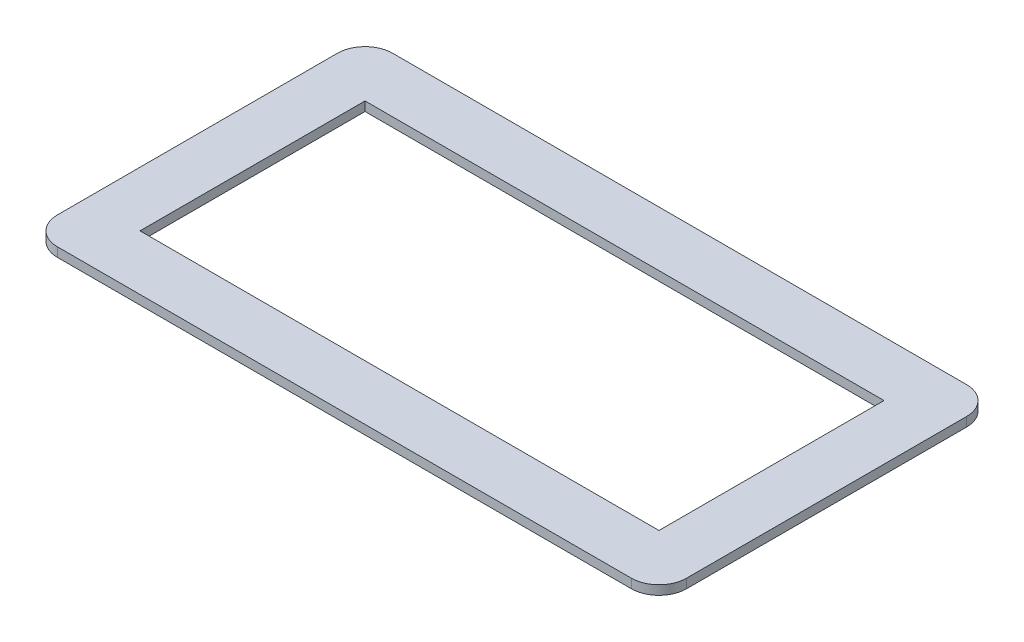
ISO-10303-21;
HEADER;
FILE_DESCRIPTION(('STEP AP214'),'2;1');
FILE_NAME('part.step','',(''),(''),'','','');
FILE_SCHEMA(('AUTOMOTIVE_DESIGN { 1 0 10303 214 1 1 1 1 }'));
ENDSEC;
DATA;
#1=APPLICATION_CONTEXT('core data for automotive mechanical design processes');
#2=APPLICATION_PROTOCOL_DEFINITION('international standard','automotive_design',2000,#1);
#3=PRODUCT_CONTEXT('',#1,'mechanical');
#4=PRODUCT('Part','Part','',(#3));
#5=PRODUCT_RELATED_PRODUCT_CATEGORY('part','',(#4));
#6=PRODUCT_DEFINITION_FORMATION('','',#4);
#7=PRODUCT_DEFINITION_CONTEXT('part definition',#1,'design');
#8=PRODUCT_DEFINITION('design','',#6,#7);
#9=PRODUCT_DEFINITION_SHAPE('','',#8);
#10=(LENGTH_UNIT() NAMED_UNIT(*) SI_UNIT(.MILLI.,.METRE.));
#11=(NAMED_UNIT(*) PLANE_ANGLE_UNIT() SI_UNIT($,.RADIAN.));
#12=(NAMED_UNIT(*) SI_UNIT($,.STERADIAN.) SOLID_ANGLE_UNIT());
#13=UNCERTAINTY_MEASURE_WITH_UNIT(LENGTH_MEASURE(1.E-05),#10,'distance_accuracy_value','');
#14=(GEOMETRIC_REPRESENTATION_CONTEXT(3) GLOBAL_UNCERTAINTY_ASSIGNED_CONTEXT((#13)) GLOBAL_UNIT_ASSIGNED_CONTEXT((#10,
#11,#12)) REPRESENTATION_CONTEXT('',''));
#15=CARTESIAN_POINT('',(0.,0.,0.));
#16=DIRECTION('',(0.,0.,1.));
#17=DIRECTION('',(1.,0.,0.));
#18=AXIS2_PLACEMENT_3D('',#15,#16,#17);
#19=CARTESIAN_POINT('',(0.,1.,0.));
#20=DIRECTION('',(0.,1.,0.));
#21=DIRECTION('',(0.,0.,1.));
#22=AXIS2_PLACEMENT_3D('',#19,#20,#21);
#23=PLANE('',#22);
#24=DIRECTION('',(0.,0.,-1.));
#25=VECTOR('',#24,1.);
#26=CARTESIAN_POINT('',(-90.6274509803921,1.,-66.9411764705883));
#27=LINE('',#26,#25);
#28=CARTESIAN_POINT('',(-90.6274509803921,1.,-33.4411764705883));
#29=VERTEX_POINT('',#28);
#30=CARTESIAN_POINT('',(-90.6274509803921,1.,-63.9411764705883));
#31=VERTEX_POINT('',#30);
#32=EDGE_CURVE('E191',#29,#31,#27,.T.);
#33=ORIENTED_EDGE('',*,*,#32,.T.);
#34=CARTESIAN_POINT('',(-93.6274509803921,1.,-63.9411764705883));
#35=DIRECTION('',(0.,1.,0.));
#36=DIRECTION('',(0.,0.,1.));
#37=AXIS2_PLACEMENT_3D('',#34,#35,#36);
#38=CIRCLE('',#37,3.);
#39=CARTESIAN_POINT('',(-93.6274509803921,1.,-66.9411764705883));
#40=VERTEX_POINT('',#39);
#41=EDGE_CURVE('E246',#31,#40,#38,.T.);
#42=ORIENTED_EDGE('',*,*,#41,.T.);
#43=DIRECTION('',(-1.,0.,0.));
#44=VECTOR('',#43,1.);
#45=CARTESIAN_POINT('',(-159.127450980392,1.,-66.9411764705883));
#46=LINE('',#45,#44);
#47=CARTESIAN_POINT('',(-156.127450980392,1.,-66.9411764705883));
#48=VERTEX_POINT('',#47);
#49=EDGE_CURVE('E195',#40,#48,#46,.T.);
#50=ORIENTED_EDGE('',*,*,#49,.T.);
#51=CARTESIAN_POINT('',(-156.127450980392,1.,-63.9411764705883));
#52=DIRECTION('',(0.,1.,0.));
#53=DIRECTION('',(0.,0.,1.));
#54=AXIS2_PLACEMENT_3D('',#51,#52,#53);
#55=CIRCLE('',#54,3.);
#56=CARTESIAN_POINT('',(-159.127450980392,1.,-63.9411764705883));
#57=VERTEX_POINT('',#56);
#58=EDGE_CURVE('E238',#48,#57,#55,.T.);
#59=ORIENTED_EDGE('',*,*,#58,.T.);
#60=DIRECTION('',(0.,0.,1.));
#61=VECTOR('',#60,1.);
#62=CARTESIAN_POINT('',(-159.127450980392,1.,-66.9411764705883));
#63=LINE('',#62,#61);
#64=CARTESIAN_POINT('',(-159.127450980392,1.,-33.4411764705883));
#65=VERTEX_POINT('',#64);
#66=EDGE_CURVE('E184',#57,#65,#63,.T.);
#67=ORIENTED_EDGE('',*,*,#66,.T.);
#68=CARTESIAN_POINT('',(-156.127450980392,1.,-33.4411764705883));
#69=DIRECTION('',(0.,1.,0.));
#70=DIRECTION('',(0.,0.,1.));
#71=AXIS2_PLACEMENT_3D('',#68,#69,#70);
#72=CIRCLE('',#71,3.);
#73=CARTESIAN_POINT('',(-156.127450980392,1.,-30.4411764705883));
#74=VERTEX_POINT('',#73);
#75=EDGE_CURVE('E62',#65,#74,#72,.T.);
#76=ORIENTED_EDGE('',*,*,#75,.T.);
#77=DIRECTION('',(1.,0.,0.));
#78=VECTOR('',#77,1.);
#79=CARTESIAN_POINT('',(-159.127450980392,1.,-30.4411764705883));
#80=LINE('',#79,#78);
#81=CARTESIAN_POINT('',(-93.6274509803921,1.,-30.4411764705883));
#82=VERTEX_POINT('',#81);
#83=EDGE_CURVE('E187',#74,#82,#80,.T.);
#84=ORIENTED_EDGE('',*,*,#83,.T.);
#85=CARTESIAN_POINT('',(-93.6274509803921,1.,-33.4411764705883));
#86=DIRECTION('',(0.,1.,0.));
#87=DIRECTION('',(0.,0.,1.));
#88=AXIS2_PLACEMENT_3D('',#85,#86,#87);
#89=CIRCLE('',#88,3.);
#90=EDGE_CURVE('E243',#82,#29,#89,.T.);
#91=ORIENTED_EDGE('',*,*,#90,.T.);
#92=EDGE_LOOP('',(#33,#42,#50,#59,#67,#76,#84,#91));
#93=FACE_BOUND('',#92,.T.);
#94=DIRECTION('',(1.,0.,0.));
#95=VECTOR('',#94,1.);
#96=CARTESIAN_POINT('',(-153.127450980392,1.,-36.4411764705883));
#97=LINE('',#96,#95);
#98=CARTESIAN_POINT('',(-153.127450980392,1.,-36.4411764705883));
#99=VERTEX_POINT('',#98);
#100=CARTESIAN_POINT('',(-96.6274509803921,1.,-36.4411764705883));
#101=VERTEX_POINT('',#100);
#102=EDGE_CURVE('E142',#99,#101,#97,.T.);
#103=ORIENTED_EDGE('',*,*,#102,.F.);
#104=DIRECTION('',(0.,0.,1.));
#105=VECTOR('',#104,1.);
#106=CARTESIAN_POINT('',(-153.127450980392,1.,-60.9411764705883));
#107=LINE('',#106,#105);
#108=CARTESIAN_POINT('',(-153.127450980392,1.,-60.9411764705883));
#109=VERTEX_POINT('',#108);
#110=EDGE_CURVE('E131',#109,#99,#107,.T.);
#111=ORIENTED_EDGE('',*,*,#110,.F.);
#112=DIRECTION('',(-1.,0.,0.));
#113=VECTOR('',#112,1.);
#114=CARTESIAN_POINT('',(-153.127450980392,1.,-60.9411764705883));
#115=LINE('',#114,#113);
#116=CARTESIAN_POINT('',(-96.6274509803921,1.,-60.9411764705883));
#117=VERTEX_POINT('',#116);
#118=EDGE_CURVE('E160',#117,#109,#115,.T.);
#119=ORIENTED_EDGE('',*,*,#118,.F.);
#120=DIRECTION('',(0.,0.,-1.));
#121=VECTOR('',#120,1.);
#122=CARTESIAN_POINT('',(-96.6274509803921,1.,-60.9411764705883));
#123=LINE('',#122,#121);
#124=EDGE_CURVE('E156',#101,#117,#123,.T.);
#125=ORIENTED_EDGE('',*,*,#124,.F.);
#126=EDGE_LOOP('',(#103,#111,#119,#125));
#127=FACE_BOUND('',#126,.T.);
#128=ADVANCED_FACE('F39',(#93,#127),#23,.T.);
#129=CARTESIAN_POINT('',(0.,0.,0.));
#130=DIRECTION('',(0.,1.,0.));
#131=DIRECTION('',(0.,0.,1.));
#132=AXIS2_PLACEMENT_3D('',#129,#130,#131);
#133=PLANE('',#132);
#134=DIRECTION('',(-1.,0.,0.));
#135=VECTOR('',#134,1.);
#136=CARTESIAN_POINT('',(-159.127450980392,0.,-66.9411764705883));
#137=LINE('',#136,#135);
#138=CARTESIAN_POINT('',(-93.6274509803921,0.,-66.9411764705883));
#139=VERTEX_POINT('',#138);
#140=CARTESIAN_POINT('',(-156.127450980392,0.,-66.9411764705883));
#141=VERTEX_POINT('',#140);
#142=EDGE_CURVE('E188',#139,#141,#137,.T.);
#143=ORIENTED_EDGE('',*,*,#142,.F.);
#144=CARTESIAN_POINT('',(-93.6274509803921,0.,-63.9411764705883));
#145=DIRECTION('',(0.,1.,0.));
#146=DIRECTION('',(0.,0.,1.));
#147=AXIS2_PLACEMENT_3D('',#144,#145,#146);
#148=CIRCLE('',#147,3.);
#149=CARTESIAN_POINT('',(-90.6274509803921,0.,-63.9411764705883));
#150=VERTEX_POINT('',#149);
#151=EDGE_CURVE('E228',#139,#150,#148,.F.);
#152=ORIENTED_EDGE('',*,*,#151,.T.);
#153=DIRECTION('',(0.,0.,-1.));
#154=VECTOR('',#153,1.);
#155=CARTESIAN_POINT('',(-90.6274509803921,0.,-66.9411764705883));
#156=LINE('',#155,#154);
#157=CARTESIAN_POINT('',(-90.6274509803921,0.,-33.4411764705883));
#158=VERTEX_POINT('',#157);
#159=EDGE_CURVE('E206',#158,#150,#156,.T.);
#160=ORIENTED_EDGE('',*,*,#159,.F.);
#161=CARTESIAN_POINT('',(-93.6274509803921,0.,-33.4411764705883));
#162=DIRECTION('',(0.,1.,0.));
#163=DIRECTION('',(0.,0.,1.));
#164=AXIS2_PLACEMENT_3D('',#161,#162,#163);
#165=CIRCLE('',#164,3.);
#166=CARTESIAN_POINT('',(-93.6274509803921,0.,-30.4411764705883));
#167=VERTEX_POINT('',#166);
#168=EDGE_CURVE('E225',#158,#167,#165,.F.);
#169=ORIENTED_EDGE('',*,*,#168,.T.);
#170=DIRECTION('',(1.,0.,0.));
#171=VECTOR('',#170,1.);
#172=CARTESIAN_POINT('',(-159.127450980392,0.,-30.4411764705883));
#173=LINE('',#172,#171);
#174=CARTESIAN_POINT('',(-156.127450980392,0.,-30.4411764705883));
#175=VERTEX_POINT('',#174);
#176=EDGE_CURVE('E203',#175,#167,#173,.T.);
#177=ORIENTED_EDGE('',*,*,#176,.F.);
#178=CARTESIAN_POINT('',(-156.127450980392,0.,-33.4411764705883));
#179=DIRECTION('',(0.,1.,0.));
#180=DIRECTION('',(0.,0.,1.));
#181=AXIS2_PLACEMENT_3D('',#178,#179,#180);
#182=CIRCLE('',#181,3.);
#183=CARTESIAN_POINT('',(-159.127450980392,0.,-33.4411764705883));
#184=VERTEX_POINT('',#183);
#185=EDGE_CURVE('E222',#175,#184,#182,.F.);
#186=ORIENTED_EDGE('',*,*,#185,.T.);
#187=DIRECTION('',(0.,0.,1.));
#188=VECTOR('',#187,1.);
#189=CARTESIAN_POINT('',(-159.127450980392,0.,-66.9411764705883));
#190=LINE('',#189,#188);
#191=CARTESIAN_POINT('',(-159.127450980392,0.,-63.9411764705883));
#192=VERTEX_POINT('',#191);
#193=EDGE_CURVE('E151',#192,#184,#190,.T.);
#194=ORIENTED_EDGE('',*,*,#193,.F.);
#195=CARTESIAN_POINT('',(-156.127450980392,0.,-63.9411764705883));
#196=DIRECTION('',(0.,1.,0.));
#197=DIRECTION('',(0.,0.,1.));
#198=AXIS2_PLACEMENT_3D('',#195,#196,#197);
#199=CIRCLE('',#198,3.);
#200=EDGE_CURVE('E219',#192,#141,#199,.F.);
#201=ORIENTED_EDGE('',*,*,#200,.T.);
#202=EDGE_LOOP('',(#143,#152,#160,#169,#177,#186,#194,#201));
#203=FACE_BOUND('',#202,.T.);
#204=DIRECTION('',(0.,0.,1.));
#205=VECTOR('',#204,1.);
#206=CARTESIAN_POINT('',(-153.127450980392,0.,-60.9411764705883));
#207=LINE('',#206,#205);
#208=CARTESIAN_POINT('',(-153.127450980392,0.,-60.9411764705883));
#209=VERTEX_POINT('',#208);
#210=CARTESIAN_POINT('',(-153.127450980392,0.,-36.4411764705883));
#211=VERTEX_POINT('',#210);
#212=EDGE_CURVE('E165',#209,#211,#207,.T.);
#213=ORIENTED_EDGE('',*,*,#212,.T.);
#214=DIRECTION('',(1.,0.,0.));
#215=VECTOR('',#214,1.);
#216=CARTESIAN_POINT('',(-153.127450980392,0.,-36.4411764705883));
#217=LINE('',#216,#215);
#218=CARTESIAN_POINT('',(-96.6274509803921,0.,-36.4411764705883));
#219=VERTEX_POINT('',#218);
#220=EDGE_CURVE('E149',#211,#219,#217,.T.);
#221=ORIENTED_EDGE('',*,*,#220,.T.);
#222=DIRECTION('',(0.,0.,-1.));
#223=VECTOR('',#222,1.);
#224=CARTESIAN_POINT('',(-96.6274509803921,0.,-60.9411764705883));
#225=LINE('',#224,#223);
#226=CARTESIAN_POINT('',(-96.6274509803921,0.,-60.9411764705883));
#227=VERTEX_POINT('',#226);
#228=EDGE_CURVE('E170',#219,#227,#225,.T.);
#229=ORIENTED_EDGE('',*,*,#228,.T.);
#230=DIRECTION('',(-1.,0.,0.));
#231=VECTOR('',#230,1.);
#232=CARTESIAN_POINT('',(-153.127450980392,0.,-60.9411764705883));
#233=LINE('',#232,#231);
#234=EDGE_CURVE('E143',#227,#209,#233,.T.);
#235=ORIENTED_EDGE('',*,*,#234,.T.);
#236=EDGE_LOOP('',(#213,#221,#229,#235));
#237=FACE_BOUND('',#236,.T.);
#238=ADVANCED_FACE('F266',(#203,#237),#133,.F.);
#239=CARTESIAN_POINT('',(-159.127450980392,1.,-66.9411764705883));
#240=DIRECTION('',(1.,0.,0.));
#241=DIRECTION('',(0.,0.,-1.));
#242=AXIS2_PLACEMENT_3D('',#239,#240,#241);
#243=PLANE('',#242);
#244=ORIENTED_EDGE('',*,*,#193,.T.);
#245=DIRECTION('',(0.,-1.,0.));
#246=VECTOR('',#245,1.);
#247=CARTESIAN_POINT('',(-159.127450980392,1.,-33.4411764705883));
#248=LINE('',#247,#246);
#249=EDGE_CURVE('E11',#184,#65,#248,.F.);
#250=ORIENTED_EDGE('',*,*,#249,.T.);
#251=ORIENTED_EDGE('',*,*,#66,.F.);
#252=DIRECTION('',(0.,-1.,0.));
#253=VECTOR('',#252,1.);
#254=CARTESIAN_POINT('',(-159.127450980392,1.,-63.9411764705883));
#255=LINE('',#254,#253);
#256=EDGE_CURVE('E48',#57,#192,#255,.T.);
#257=ORIENTED_EDGE('',*,*,#256,.T.);
#258=EDGE_LOOP('',(#244,#250,#251,#257));
#259=FACE_BOUND('',#258,.T.);
#260=ADVANCED_FACE('F260',(#259),#243,.F.);
#261=CARTESIAN_POINT('',(-159.127450980392,1.,-30.4411764705883));
#262=DIRECTION('',(0.,0.,-1.));
#263=DIRECTION('',(-1.,0.,0.));
#264=AXIS2_PLACEMENT_3D('',#261,#262,#263);
#265=PLANE('',#264);
#266=ORIENTED_EDGE('',*,*,#176,.T.);
#267=DIRECTION('',(0.,-1.,0.));
#268=VECTOR('',#267,1.);
#269=CARTESIAN_POINT('',(-93.6274509803921,1.,-30.4411764705883));
#270=LINE('',#269,#268);
#271=EDGE_CURVE('E55',#167,#82,#270,.F.);
#272=ORIENTED_EDGE('',*,*,#271,.T.);
#273=ORIENTED_EDGE('',*,*,#83,.F.);
#274=DIRECTION('',(0.,-1.,0.));
#275=VECTOR('',#274,1.);
#276=CARTESIAN_POINT('',(-156.127450980392,1.,-30.4411764705883));
#277=LINE('',#276,#275);
#278=EDGE_CURVE('E249',#74,#175,#277,.T.);
#279=ORIENTED_EDGE('',*,*,#278,.T.);
#280=EDGE_LOOP('',(#266,#272,#273,#279));
#281=FACE_BOUND('',#280,.T.);
#282=ADVANCED_FACE('F272',(#281),#265,.F.);
#283=CARTESIAN_POINT('',(-90.6274509803921,1.,-66.9411764705883));
#284=DIRECTION('',(-1.,0.,0.));
#285=DIRECTION('',(0.,0.,1.));
#286=AXIS2_PLACEMENT_3D('',#283,#284,#285);
#287=PLANE('',#286);
#288=ORIENTED_EDGE('',*,*,#159,.T.);
#289=DIRECTION('',(0.,-1.,0.));
#290=VECTOR('',#289,1.);
#291=CARTESIAN_POINT('',(-90.6274509803921,1.,-63.9411764705883));
#292=LINE('',#291,#290);
#293=EDGE_CURVE('E235',#150,#31,#292,.F.);
#294=ORIENTED_EDGE('',*,*,#293,.T.);
#295=ORIENTED_EDGE('',*,*,#32,.F.);
#296=DIRECTION('',(0.,-1.,0.));
#297=VECTOR('',#296,1.);
#298=CARTESIAN_POINT('',(-90.6274509803921,1.,-33.4411764705883));
#299=LINE('',#298,#297);
#300=EDGE_CURVE('E231',#29,#158,#299,.T.);
#301=ORIENTED_EDGE('',*,*,#300,.T.);
#302=EDGE_LOOP('',(#288,#294,#295,#301));
#303=FACE_BOUND('',#302,.T.);
#304=ADVANCED_FACE('F280',(#303),#287,.F.);
#305=CARTESIAN_POINT('',(-159.127450980392,1.,-66.9411764705883));
#306=DIRECTION('',(0.,0.,1.));
#307=DIRECTION('',(1.,0.,0.));
#308=AXIS2_PLACEMENT_3D('',#305,#306,#307);
#309=PLANE('',#308);
#310=ORIENTED_EDGE('',*,*,#49,.F.);
#311=DIRECTION('',(0.,-1.,0.));
#312=VECTOR('',#311,1.);
#313=CARTESIAN_POINT('',(-93.6274509803921,1.,-66.9411764705883));
#314=LINE('',#313,#312);
#315=EDGE_CURVE('E215',#40,#139,#314,.T.);
#316=ORIENTED_EDGE('',*,*,#315,.T.);
#317=ORIENTED_EDGE('',*,*,#142,.T.);
#318=DIRECTION('',(0.,-1.,0.));
#319=VECTOR('',#318,1.);
#320=CARTESIAN_POINT('',(-156.127450980392,1.,-66.9411764705883));
#321=LINE('',#320,#319);
#322=EDGE_CURVE('E199',#141,#48,#321,.F.);
#323=ORIENTED_EDGE('',*,*,#322,.T.);
#324=EDGE_LOOP('',(#310,#316,#317,#323));
#325=FACE_BOUND('',#324,.T.);
#326=ADVANCED_FACE('F288',(#325),#309,.F.);
#327=CARTESIAN_POINT('',(-153.127450980392,1.,-60.9411764705883));
#328=DIRECTION('',(1.,0.,0.));
#329=DIRECTION('',(0.,0.,-1.));
#330=AXIS2_PLACEMENT_3D('',#327,#328,#329);
#331=PLANE('',#330);
#332=ORIENTED_EDGE('',*,*,#212,.F.);
#333=DIRECTION('',(0.,-1.,0.));
#334=VECTOR('',#333,1.);
#335=CARTESIAN_POINT('',(-153.127450980392,1.,-60.9411764705883));
#336=LINE('',#335,#334);
#337=EDGE_CURVE('E137',#109,#209,#336,.T.);
#338=ORIENTED_EDGE('',*,*,#337,.F.);
#339=ORIENTED_EDGE('',*,*,#110,.T.);
#340=DIRECTION('',(0.,-1.,0.));
#341=VECTOR('',#340,1.);
#342=CARTESIAN_POINT('',(-153.127450980392,1.,-36.4411764705883));
#343=LINE('',#342,#341);
#344=EDGE_CURVE('E134',#99,#211,#343,.T.);
#345=ORIENTED_EDGE('',*,*,#344,.T.);
#346=EDGE_LOOP('',(#332,#338,#339,#345));
#347=FACE_BOUND('',#346,.T.);
#348=ADVANCED_FACE('F133',(#347),#331,.T.);
#349=CARTESIAN_POINT('',(-153.127450980392,1.,-36.4411764705883));
#350=DIRECTION('',(0.,0.,-1.));
#351=DIRECTION('',(-1.,0.,0.));
#352=AXIS2_PLACEMENT_3D('',#349,#350,#351);
#353=PLANE('',#352);
#354=ORIENTED_EDGE('',*,*,#220,.F.);
#355=ORIENTED_EDGE('',*,*,#344,.F.);
#356=ORIENTED_EDGE('',*,*,#102,.T.);
#357=DIRECTION('',(0.,-1.,0.));
#358=VECTOR('',#357,1.);
#359=CARTESIAN_POINT('',(-96.6274509803921,1.,-36.4411764705883));
#360=LINE('',#359,#358);
#361=EDGE_CURVE('E152',#101,#219,#360,.T.);
#362=ORIENTED_EDGE('',*,*,#361,.T.);
#363=EDGE_LOOP('',(#354,#355,#356,#362));
#364=FACE_BOUND('',#363,.T.);
#365=ADVANCED_FACE('F146',(#364),#353,.T.);
#366=CARTESIAN_POINT('',(-96.6274509803921,1.,-60.9411764705883));
#367=DIRECTION('',(-1.,0.,0.));
#368=DIRECTION('',(0.,0.,1.));
#369=AXIS2_PLACEMENT_3D('',#366,#367,#368);
#370=PLANE('',#369);
#371=ORIENTED_EDGE('',*,*,#228,.F.);
#372=ORIENTED_EDGE('',*,*,#361,.F.);
#373=ORIENTED_EDGE('',*,*,#124,.T.);
#374=DIRECTION('',(0.,-1.,0.));
#375=VECTOR('',#374,1.);
#376=CARTESIAN_POINT('',(-96.6274509803921,1.,-60.9411764705883));
#377=LINE('',#376,#375);
#378=EDGE_CURVE('E179',#117,#227,#377,.T.);
#379=ORIENTED_EDGE('',*,*,#378,.T.);
#380=EDGE_LOOP('',(#371,#372,#373,#379));
#381=FACE_BOUND('',#380,.T.);
#382=ADVANCED_FACE('F344',(#381),#370,.T.);
#383=CARTESIAN_POINT('',(-153.127450980392,1.,-60.9411764705883));
#384=DIRECTION('',(0.,0.,1.));
#385=DIRECTION('',(1.,0.,0.));
#386=AXIS2_PLACEMENT_3D('',#383,#384,#385);
#387=PLANE('',#386);
#388=ORIENTED_EDGE('',*,*,#234,.F.);
#389=ORIENTED_EDGE('',*,*,#378,.F.);
#390=ORIENTED_EDGE('',*,*,#118,.T.);
#391=ORIENTED_EDGE('',*,*,#337,.T.);
#392=EDGE_LOOP('',(#388,#389,#390,#391));
#393=FACE_BOUND('',#392,.T.);
#394=ADVANCED_FACE('F313',(#393),#387,.T.);
#395=CARTESIAN_POINT('',(-93.6274509803921,1.,-63.9411764705883));
#396=DIRECTION('',(0.,-1.,0.));
#397=DIRECTION('',(0.,0.,-1.));
#398=AXIS2_PLACEMENT_3D('',#395,#396,#397);
#399=CYLINDRICAL_SURFACE('',#398,3.);
#400=ORIENTED_EDGE('',*,*,#41,.F.);
#401=ORIENTED_EDGE('',*,*,#293,.F.);
#402=ORIENTED_EDGE('',*,*,#151,.F.);
#403=ORIENTED_EDGE('',*,*,#315,.F.);
#404=EDGE_LOOP('',(#400,#401,#402,#403));
#405=FACE_BOUND('',#404,.T.);
#406=ADVANCED_FACE('F285',(#405),#399,.T.);
#407=CARTESIAN_POINT('',(-93.6274509803921,1.,-33.4411764705883));
#408=DIRECTION('',(0.,-1.,0.));
#409=DIRECTION('',(0.,0.,-1.));
#410=AXIS2_PLACEMENT_3D('',#407,#408,#409);
#411=CYLINDRICAL_SURFACE('',#410,3.);
#412=ORIENTED_EDGE('',*,*,#90,.F.);
#413=ORIENTED_EDGE('',*,*,#271,.F.);
#414=ORIENTED_EDGE('',*,*,#168,.F.);
#415=ORIENTED_EDGE('',*,*,#300,.F.);
#416=EDGE_LOOP('',(#412,#413,#414,#415));
#417=FACE_BOUND('',#416,.T.);
#418=ADVANCED_FACE('F277',(#417),#411,.T.);
#419=CARTESIAN_POINT('',(-156.127450980392,1.,-33.4411764705883));
#420=DIRECTION('',(0.,-1.,0.));
#421=DIRECTION('',(0.,0.,-1.));
#422=AXIS2_PLACEMENT_3D('',#419,#420,#421);
#423=CYLINDRICAL_SURFACE('',#422,3.);
#424=ORIENTED_EDGE('',*,*,#75,.F.);
#425=ORIENTED_EDGE('',*,*,#249,.F.);
#426=ORIENTED_EDGE('',*,*,#185,.F.);
#427=ORIENTED_EDGE('',*,*,#278,.F.);
#428=EDGE_LOOP('',(#424,#425,#426,#427));
#429=FACE_BOUND('',#428,.T.);
#430=ADVANCED_FACE('F271',(#429),#423,.T.);
#431=CARTESIAN_POINT('',(-156.127450980392,1.,-63.9411764705883));
#432=DIRECTION('',(0.,-1.,0.));
#433=DIRECTION('',(0.,0.,-1.));
#434=AXIS2_PLACEMENT_3D('',#431,#432,#433);
#435=CYLINDRICAL_SURFACE('',#434,3.);
#436=ORIENTED_EDGE('',*,*,#58,.F.);
#437=ORIENTED_EDGE('',*,*,#322,.F.);
#438=ORIENTED_EDGE('',*,*,#200,.F.);
#439=ORIENTED_EDGE('',*,*,#256,.F.);
#440=EDGE_LOOP('',(#436,#437,#438,#439));
#441=FACE_BOUND('',#440,.T.);
#442=ADVANCED_FACE('F41',(#441),#435,.T.);
#443=CLOSED_SHELL('',(#128,#238,#260,#282,#304,#326,#348,#365,#382,#394,#406,#418,#430,#442));
#444=MANIFOLD_SOLID_BREP('B2',#443);
#445=ADVANCED_BREP_SHAPE_REPRESENTATION('',(#18,#444),#14);
#446=SHAPE_DEFINITION_REPRESENTATION(#9,#445);
ENDSEC;
END-ISO-10303-21;
